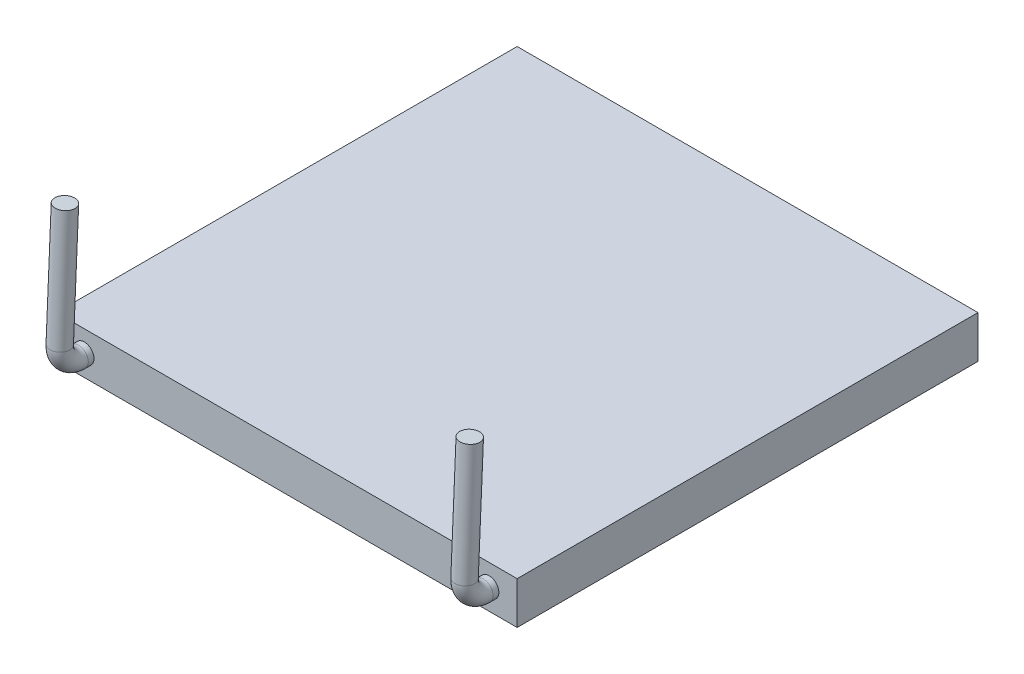
ISO-10303-21;
HEADER;
FILE_DESCRIPTION(('STEP AP214'),'2;1');
FILE_NAME('part.step','',(''),(''),'','','');
FILE_SCHEMA(('AUTOMOTIVE_DESIGN { 1 0 10303 214 1 1 1 1 }'));
ENDSEC;
DATA;
#1=APPLICATION_CONTEXT('core data for automotive mechanical design processes');
#2=APPLICATION_PROTOCOL_DEFINITION('international standard','automotive_design',2000,#1);
#3=PRODUCT_CONTEXT('',#1,'mechanical');
#4=PRODUCT('Part','Part','',(#3));
#5=PRODUCT_RELATED_PRODUCT_CATEGORY('part','',(#4));
#6=PRODUCT_DEFINITION_FORMATION('','',#4);
#7=PRODUCT_DEFINITION_CONTEXT('part definition',#1,'design');
#8=PRODUCT_DEFINITION('design','',#6,#7);
#9=PRODUCT_DEFINITION_SHAPE('','',#8);
#10=(LENGTH_UNIT() NAMED_UNIT(*) SI_UNIT(.MILLI.,.METRE.));
#11=(NAMED_UNIT(*) PLANE_ANGLE_UNIT() SI_UNIT($,.RADIAN.));
#12=(NAMED_UNIT(*) SI_UNIT($,.STERADIAN.) SOLID_ANGLE_UNIT());
#13=UNCERTAINTY_MEASURE_WITH_UNIT(LENGTH_MEASURE(1.E-05),#10,'distance_accuracy_value','');
#14=(GEOMETRIC_REPRESENTATION_CONTEXT(3) GLOBAL_UNCERTAINTY_ASSIGNED_CONTEXT((#13)) GLOBAL_UNIT_ASSIGNED_CONTEXT((#10,
#11,#12)) REPRESENTATION_CONTEXT('',''));
#15=CARTESIAN_POINT('',(0.,0.,0.));
#16=DIRECTION('',(0.,0.,1.));
#17=DIRECTION('',(1.,0.,0.));
#18=AXIS2_PLACEMENT_3D('',#15,#16,#17);
#19=CARTESIAN_POINT('',(-20.15,3.7,20.15));
#20=DIRECTION('',(0.,0.,-1.));
#21=DIRECTION('',(-1.,0.,0.));
#22=AXIS2_PLACEMENT_3D('',#19,#20,#21);
#23=PLANE('',#22);
#24=CARTESIAN_POINT('',(17.7,1.85,20.15));
#25=DIRECTION('',(0.,0.,-1.));
#26=DIRECTION('',(-1.,0.,0.));
#27=AXIS2_PLACEMENT_3D('',#24,#25,#26);
#28=CIRCLE('',#27,0.85);
#29=CARTESIAN_POINT('',(16.85,1.85,20.15));
#30=VERTEX_POINT('',#29);
#31=EDGE_CURVE('E264',#30,#30,#28,.T.);
#32=ORIENTED_EDGE('',*,*,#31,.T.);
#33=EDGE_LOOP('',(#32));
#34=FACE_BOUND('',#33,.T.);
#35=DIRECTION('',(1.,0.,0.));
#36=VECTOR('',#35,1.);
#37=CARTESIAN_POINT('',(-20.15,0.,20.15));
#38=LINE('',#37,#36);
#39=CARTESIAN_POINT('',(-20.15,0.,20.15));
#40=VERTEX_POINT('',#39);
#41=CARTESIAN_POINT('',(20.15,0.,20.15));
#42=VERTEX_POINT('',#41);
#43=EDGE_CURVE('E89',#40,#42,#38,.T.);
#44=ORIENTED_EDGE('',*,*,#43,.T.);
#45=DIRECTION('',(0.,-1.,0.));
#46=VECTOR('',#45,1.);
#47=CARTESIAN_POINT('',(20.15,3.7,20.15));
#48=LINE('',#47,#46);
#49=CARTESIAN_POINT('',(20.15,3.7,20.15));
#50=VERTEX_POINT('',#49);
#51=EDGE_CURVE('E112',#50,#42,#48,.T.);
#52=ORIENTED_EDGE('',*,*,#51,.F.);
#53=DIRECTION('',(1.,0.,0.));
#54=VECTOR('',#53,1.);
#55=CARTESIAN_POINT('',(-20.15,3.7,20.15));
#56=LINE('',#55,#54);
#57=CARTESIAN_POINT('',(-20.15,3.7,20.15));
#58=VERTEX_POINT('',#57);
#59=EDGE_CURVE('E66',#58,#50,#56,.T.);
#60=ORIENTED_EDGE('',*,*,#59,.F.);
#61=DIRECTION('',(0.,-1.,0.));
#62=VECTOR('',#61,1.);
#63=CARTESIAN_POINT('',(-20.15,3.7,20.15));
#64=LINE('',#63,#62);
#65=EDGE_CURVE('E108',#58,#40,#64,.T.);
#66=ORIENTED_EDGE('',*,*,#65,.T.);
#67=EDGE_LOOP('',(#44,#52,#60,#66));
#68=FACE_BOUND('',#67,.T.);
#69=CARTESIAN_POINT('',(-17.7,1.85,20.15));
#70=DIRECTION('',(0.,0.,-1.));
#71=DIRECTION('',(-1.,0.,0.));
#72=AXIS2_PLACEMENT_3D('',#69,#70,#71);
#73=CIRCLE('',#72,0.85);
#74=CARTESIAN_POINT('',(-18.55,1.85,20.15));
#75=VERTEX_POINT('',#74);
#76=EDGE_CURVE('E13',#75,#75,#73,.F.);
#77=ORIENTED_EDGE('',*,*,#76,.F.);
#78=EDGE_LOOP('',(#77));
#79=FACE_BOUND('',#78,.T.);
#80=ADVANCED_FACE('F48',(#34,#68,#79),#23,.F.);
#81=CARTESIAN_POINT('',(20.15,3.7,-20.15));
#82=DIRECTION('',(-1.,0.,0.));
#83=DIRECTION('',(0.,0.,1.));
#84=AXIS2_PLACEMENT_3D('',#81,#82,#83);
#85=PLANE('',#84);
#86=DIRECTION('',(0.,0.,-1.));
#87=VECTOR('',#86,1.);
#88=CARTESIAN_POINT('',(20.15,0.,-20.15));
#89=LINE('',#88,#87);
#90=CARTESIAN_POINT('',(20.15,0.,-20.15));
#91=VERTEX_POINT('',#90);
#92=EDGE_CURVE('E116',#42,#91,#89,.T.);
#93=ORIENTED_EDGE('',*,*,#92,.T.);
#94=DIRECTION('',(0.,-1.,0.));
#95=VECTOR('',#94,1.);
#96=CARTESIAN_POINT('',(20.15,3.7,-20.15));
#97=LINE('',#96,#95);
#98=CARTESIAN_POINT('',(20.15,3.7,-20.15));
#99=VERTEX_POINT('',#98);
#100=EDGE_CURVE('E58',#99,#91,#97,.T.);
#101=ORIENTED_EDGE('',*,*,#100,.F.);
#102=DIRECTION('',(0.,0.,-1.));
#103=VECTOR('',#102,1.);
#104=CARTESIAN_POINT('',(20.15,3.7,-20.15));
#105=LINE('',#104,#103);
#106=EDGE_CURVE('E102',#50,#99,#105,.T.);
#107=ORIENTED_EDGE('',*,*,#106,.F.);
#108=ORIENTED_EDGE('',*,*,#51,.T.);
#109=EDGE_LOOP('',(#93,#101,#107,#108));
#110=FACE_BOUND('',#109,.T.);
#111=ADVANCED_FACE('F50',(#110),#85,.F.);
#112=CARTESIAN_POINT('',(-20.15,3.7,-20.15));
#113=DIRECTION('',(0.,0.,1.));
#114=DIRECTION('',(1.,0.,0.));
#115=AXIS2_PLACEMENT_3D('',#112,#113,#114);
#116=PLANE('',#115);
#117=DIRECTION('',(-1.,0.,0.));
#118=VECTOR('',#117,1.);
#119=CARTESIAN_POINT('',(-20.15,0.,-20.15));
#120=LINE('',#119,#118);
#121=CARTESIAN_POINT('',(-20.15,0.,-20.15));
#122=VERTEX_POINT('',#121);
#123=EDGE_CURVE('E107',#91,#122,#120,.T.);
#124=ORIENTED_EDGE('',*,*,#123,.T.);
#125=DIRECTION('',(0.,-1.,0.));
#126=VECTOR('',#125,1.);
#127=CARTESIAN_POINT('',(-20.15,3.7,-20.15));
#128=LINE('',#127,#126);
#129=CARTESIAN_POINT('',(-20.15,3.7,-20.15));
#130=VERTEX_POINT('',#129);
#131=EDGE_CURVE('E105',#130,#122,#128,.T.);
#132=ORIENTED_EDGE('',*,*,#131,.F.);
#133=DIRECTION('',(-1.,0.,0.));
#134=VECTOR('',#133,1.);
#135=CARTESIAN_POINT('',(-20.15,3.7,-20.15));
#136=LINE('',#135,#134);
#137=EDGE_CURVE('E97',#99,#130,#136,.T.);
#138=ORIENTED_EDGE('',*,*,#137,.F.);
#139=ORIENTED_EDGE('',*,*,#100,.T.);
#140=EDGE_LOOP('',(#124,#132,#138,#139));
#141=FACE_BOUND('',#140,.T.);
#142=ADVANCED_FACE('F106',(#141),#116,.F.);
#143=CARTESIAN_POINT('',(-20.15,3.7,-20.15));
#144=DIRECTION('',(1.,0.,0.));
#145=DIRECTION('',(0.,0.,-1.));
#146=AXIS2_PLACEMENT_3D('',#143,#144,#145);
#147=PLANE('',#146);
#148=DIRECTION('',(0.,0.,1.));
#149=VECTOR('',#148,1.);
#150=CARTESIAN_POINT('',(-20.15,0.,-20.15));
#151=LINE('',#150,#149);
#152=EDGE_CURVE('E83',#122,#40,#151,.T.);
#153=ORIENTED_EDGE('',*,*,#152,.T.);
#154=ORIENTED_EDGE('',*,*,#65,.F.);
#155=DIRECTION('',(0.,0.,1.));
#156=VECTOR('',#155,1.);
#157=CARTESIAN_POINT('',(-20.15,3.7,-20.15));
#158=LINE('',#157,#156);
#159=EDGE_CURVE('E100',#130,#58,#158,.T.);
#160=ORIENTED_EDGE('',*,*,#159,.F.);
#161=ORIENTED_EDGE('',*,*,#131,.T.);
#162=EDGE_LOOP('',(#153,#154,#160,#161));
#163=FACE_BOUND('',#162,.T.);
#164=ADVANCED_FACE('F110',(#163),#147,.F.);
#165=CARTESIAN_POINT('',(0.,3.7,0.));
#166=DIRECTION('',(0.,1.,0.));
#167=DIRECTION('',(0.,0.,1.));
#168=AXIS2_PLACEMENT_3D('',#165,#166,#167);
#169=PLANE('',#168);
#170=ORIENTED_EDGE('',*,*,#106,.T.);
#171=ORIENTED_EDGE('',*,*,#137,.T.);
#172=ORIENTED_EDGE('',*,*,#159,.T.);
#173=ORIENTED_EDGE('',*,*,#59,.T.);
#174=EDGE_LOOP('',(#170,#171,#172,#173));
#175=FACE_BOUND('',#174,.T.);
#176=ADVANCED_FACE('F98',(#175),#169,.T.);
#177=CARTESIAN_POINT('',(0.,0.,0.));
#178=DIRECTION('',(0.,1.,0.));
#179=DIRECTION('',(0.,0.,1.));
#180=AXIS2_PLACEMENT_3D('',#177,#178,#179);
#181=PLANE('',#180);
#182=ORIENTED_EDGE('',*,*,#92,.F.);
#183=ORIENTED_EDGE('',*,*,#43,.F.);
#184=ORIENTED_EDGE('',*,*,#152,.F.);
#185=ORIENTED_EDGE('',*,*,#123,.F.);
#186=EDGE_LOOP('',(#182,#183,#184,#185));
#187=FACE_BOUND('',#186,.T.);
#188=ADVANCED_FACE('F127',(#187),#181,.F.);
#189=CARTESIAN_POINT('',(-17.7,1.85,20.65));
#190=DIRECTION('',(0.,0.,-1.));
#191=DIRECTION('',(-1.,0.,0.));
#192=AXIS2_PLACEMENT_3D('',#189,#190,#191);
#193=CYLINDRICAL_SURFACE('',#192,0.85);
#194=CARTESIAN_POINT('',(-17.7,1.85,20.65));
#195=DIRECTION('',(0.,0.,1.));
#196=DIRECTION('',(1.,0.,0.));
#197=AXIS2_PLACEMENT_3D('',#194,#195,#196);
#198=CIRCLE('',#197,0.85);
#199=CARTESIAN_POINT('',(-17.7,1.,20.65));
#200=VERTEX_POINT('',#199);
#201=EDGE_CURVE('E52',#200,#200,#198,.T.);
#202=ORIENTED_EDGE('',*,*,#201,.F.);
#203=EDGE_LOOP('',(#202));
#204=FACE_BOUND('',#203,.T.);
#205=ORIENTED_EDGE('',*,*,#76,.T.);
#206=EDGE_LOOP('',(#205));
#207=FACE_BOUND('',#206,.T.);
#208=ADVANCED_FACE('F129',(#204,#207),#193,.T.);
#209=CARTESIAN_POINT('',(-17.7,3.5015628353161,20.65));
#210=DIRECTION('',(1.,0.,0.));
#211=DIRECTION('',(0.,0.,-1.));
#212=AXIS2_PLACEMENT_3D('',#209,#210,#211);
#213=TOROIDAL_SURFACE('',#212,1.6515628353161,0.85);
#214=CARTESIAN_POINT('',(-17.7,3.57339457619274,22.3));
#215=DIRECTION('',(0.,0.999053723368748,-0.0434931928356733));
#216=DIRECTION('',(1.,0.,0.));
#217=AXIS2_PLACEMENT_3D('',#214,#215,#216);
#218=CIRCLE('',#217,0.85);
#219=CARTESIAN_POINT('',(-17.7,3.61036379010306,23.1491956648634));
#220=VERTEX_POINT('',#219);
#221=EDGE_CURVE('E274',#220,#220,#218,.T.);
#222=CARTESIAN_POINT('',(-17.7,3.5015628353161,20.65));
#223=DIRECTION('',(1.,0.,0.));
#224=DIRECTION('',(0.,0.,-1.));
#225=AXIS2_PLACEMENT_3D('',#222,#223,#224);
#226=CIRCLE('',#225,2.5015628353161);
#227=EDGE_CURVE('',#220,#200,#226,.T.);
#228=ORIENTED_EDGE('',*,*,#221,.F.);
#229=ORIENTED_EDGE('',*,*,#201,.T.);
#230=ORIENTED_EDGE('',*,*,#227,.T.);
#231=ORIENTED_EDGE('',*,*,#227,.F.);
#232=EDGE_LOOP('',(#228,#230,#229,#231));
#233=FACE_BOUND('',#232,.T.);
#234=ADVANCED_FACE('F135',(#233),#213,.T.);
#235=CARTESIAN_POINT('',(-17.7,14.0634586715646,21.8433214752254));
#236=DIRECTION('',(0.,-0.999053723368748,0.0434931928356733));
#237=DIRECTION('',(0.,-0.0434931928356733,-0.999053723368748));
#238=AXIS2_PLACEMENT_3D('',#235,#236,#237);
#239=CYLINDRICAL_SURFACE('',#238,0.85);
#240=CARTESIAN_POINT('',(-17.7,14.0634586715646,21.8433214752254));
#241=DIRECTION('',(0.,0.999053723368748,-0.0434931928356733));
#242=DIRECTION('',(0.,0.0434931928356733,0.999053723368748));
#243=AXIS2_PLACEMENT_3D('',#240,#241,#242);
#244=CIRCLE('',#243,0.85);
#245=CARTESIAN_POINT('',(-17.7,14.1004278854749,22.6925171400889));
#246=VERTEX_POINT('',#245);
#247=EDGE_CURVE('E270',#246,#246,#244,.T.);
#248=ORIENTED_EDGE('',*,*,#247,.F.);
#249=EDGE_LOOP('',(#248));
#250=FACE_BOUND('',#249,.T.);
#251=ORIENTED_EDGE('',*,*,#221,.T.);
#252=EDGE_LOOP('',(#251));
#253=FACE_BOUND('',#252,.T.);
#254=ADVANCED_FACE('F184',(#250,#253),#239,.T.);
#255=CARTESIAN_POINT('',(-17.7,14.0634586715646,21.8433214752254));
#256=DIRECTION('',(0.,0.999053723368748,-0.0434931928356733));
#257=DIRECTION('',(0.,0.0434931928356733,0.999053723368748));
#258=AXIS2_PLACEMENT_3D('',#255,#256,#257);
#259=PLANE('',#258);
#260=ORIENTED_EDGE('',*,*,#247,.T.);
#261=EDGE_LOOP('',(#260));
#262=FACE_BOUND('',#261,.T.);
#263=ADVANCED_FACE('F194',(#262),#259,.T.);
#264=CARTESIAN_POINT('',(17.7,1.85,20.65));
#265=DIRECTION('',(0.,0.,-1.));
#266=DIRECTION('',(-1.,0.,0.));
#267=AXIS2_PLACEMENT_3D('',#264,#265,#266);
#268=CYLINDRICAL_SURFACE('',#267,0.85);
#269=CARTESIAN_POINT('',(17.7,1.85,20.65));
#270=DIRECTION('',(0.,0.,-1.));
#271=DIRECTION('',(-1.,0.,0.));
#272=AXIS2_PLACEMENT_3D('',#269,#270,#271);
#273=CIRCLE('',#272,0.85);
#274=CARTESIAN_POINT('',(17.7,1.,20.65));
#275=VERTEX_POINT('',#274);
#276=EDGE_CURVE('E267',#275,#275,#273,.T.);
#277=ORIENTED_EDGE('',*,*,#276,.T.);
#278=EDGE_LOOP('',(#277));
#279=FACE_BOUND('',#278,.T.);
#280=ORIENTED_EDGE('',*,*,#31,.F.);
#281=EDGE_LOOP('',(#280));
#282=FACE_BOUND('',#281,.T.);
#283=ADVANCED_FACE('F203',(#279,#282),#268,.T.);
#284=CARTESIAN_POINT('',(17.7,3.5015628353161,20.65));
#285=DIRECTION('',(1.,0.,0.));
#286=DIRECTION('',(0.,0.,-1.));
#287=AXIS2_PLACEMENT_3D('',#284,#285,#286);
#288=TOROIDAL_SURFACE('',#287,1.6515628353161,0.85);
#289=CARTESIAN_POINT('',(17.7,3.57339457619274,22.3));
#290=DIRECTION('',(0.,-0.999053723368748,0.0434931928356733));
#291=DIRECTION('',(-1.,0.,0.));
#292=AXIS2_PLACEMENT_3D('',#289,#290,#291);
#293=CIRCLE('',#292,0.85);
#294=CARTESIAN_POINT('',(17.7,3.61036379010306,23.1491956648634));
#295=VERTEX_POINT('',#294);
#296=EDGE_CURVE('E261',#295,#295,#293,.T.);
#297=CARTESIAN_POINT('',(17.7,3.5015628353161,20.65));
#298=DIRECTION('',(1.,0.,0.));
#299=DIRECTION('',(0.,0.,-1.));
#300=AXIS2_PLACEMENT_3D('',#297,#298,#299);
#301=CIRCLE('',#300,2.5015628353161);
#302=EDGE_CURVE('',#295,#275,#301,.T.);
#303=ORIENTED_EDGE('',*,*,#296,.T.);
#304=ORIENTED_EDGE('',*,*,#276,.F.);
#305=ORIENTED_EDGE('',*,*,#302,.T.);
#306=ORIENTED_EDGE('',*,*,#302,.F.);
#307=EDGE_LOOP('',(#303,#305,#304,#306));
#308=FACE_BOUND('',#307,.T.);
#309=ADVANCED_FACE('F218',(#308),#288,.T.);
#310=CARTESIAN_POINT('',(17.7,14.0634586715646,21.8433214752254));
#311=DIRECTION('',(0.,-0.999053723368748,0.0434931928356733));
#312=DIRECTION('',(0.,-0.0434931928356733,-0.999053723368748));
#313=AXIS2_PLACEMENT_3D('',#310,#311,#312);
#314=CYLINDRICAL_SURFACE('',#313,0.85);
#315=CARTESIAN_POINT('',(17.7,14.0634586715646,21.8433214752254));
#316=DIRECTION('',(0.,-0.999053723368748,0.0434931928356733));
#317=DIRECTION('',(0.,0.0434931928356733,0.999053723368748));
#318=AXIS2_PLACEMENT_3D('',#315,#316,#317);
#319=CIRCLE('',#318,0.85);
#320=CARTESIAN_POINT('',(17.7,14.1004278854749,22.6925171400889));
#321=VERTEX_POINT('',#320);
#322=EDGE_CURVE('E260',#321,#321,#319,.T.);
#323=ORIENTED_EDGE('',*,*,#322,.T.);
#324=EDGE_LOOP('',(#323));
#325=FACE_BOUND('',#324,.T.);
#326=ORIENTED_EDGE('',*,*,#296,.F.);
#327=EDGE_LOOP('',(#326));
#328=FACE_BOUND('',#327,.T.);
#329=ADVANCED_FACE('F229',(#325,#328),#314,.T.);
#330=CARTESIAN_POINT('',(17.7,14.0634586715646,21.8433214752254));
#331=DIRECTION('',(0.,0.999053723368748,-0.0434931928356733));
#332=DIRECTION('',(0.,0.0434931928356733,0.999053723368748));
#333=AXIS2_PLACEMENT_3D('',#330,#331,#332);
#334=PLANE('',#333);
#335=ORIENTED_EDGE('',*,*,#322,.F.);
#336=EDGE_LOOP('',(#335));
#337=FACE_BOUND('',#336,.T.);
#338=ADVANCED_FACE('F240',(#337),#334,.T.);
#339=CLOSED_SHELL('',(#80,#111,#142,#164,#176,#188,#208,#234,#254,#263,#283,#309,#329,#338));
#340=MANIFOLD_SOLID_BREP('B2',#339);
#341=ADVANCED_BREP_SHAPE_REPRESENTATION('',(#18,#340),#14);
#342=SHAPE_DEFINITION_REPRESENTATION(#9,#341);
ENDSEC;
END-ISO-10303-21;
